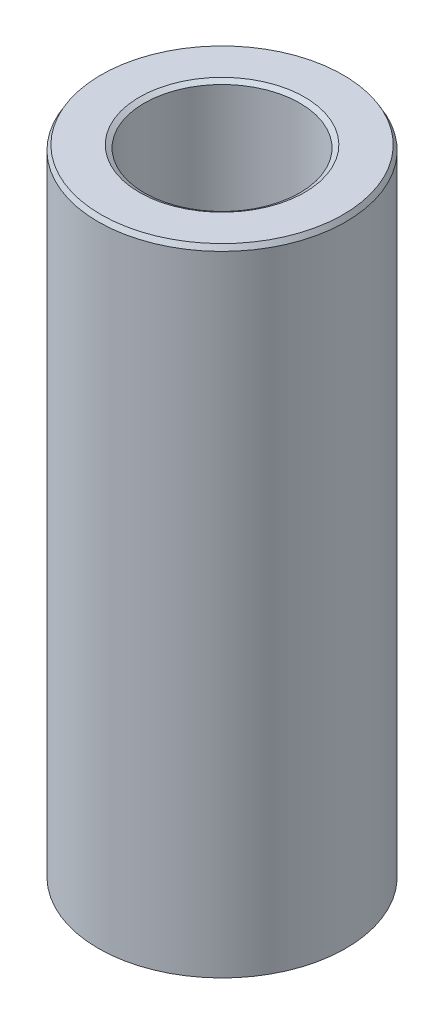
ISO-10303-21;
HEADER;
FILE_DESCRIPTION(('STEP AP214'),'2;1');
FILE_NAME('part.step','',(''),(''),'','','');
FILE_SCHEMA(('AUTOMOTIVE_DESIGN { 1 0 10303 214 1 1 1 1 }'));
ENDSEC;
DATA;
#1=APPLICATION_CONTEXT('core data for automotive mechanical design processes');
#2=APPLICATION_PROTOCOL_DEFINITION('international standard','automotive_design',2000,#1);
#3=PRODUCT_CONTEXT('',#1,'mechanical');
#4=PRODUCT('Part','Part','',(#3));
#5=PRODUCT_RELATED_PRODUCT_CATEGORY('part','',(#4));
#6=PRODUCT_DEFINITION_FORMATION('','',#4);
#7=PRODUCT_DEFINITION_CONTEXT('part definition',#1,'design');
#8=PRODUCT_DEFINITION('design','',#6,#7);
#9=PRODUCT_DEFINITION_SHAPE('','',#8);
#10=(LENGTH_UNIT() NAMED_UNIT(*) SI_UNIT(.MILLI.,.METRE.));
#11=(NAMED_UNIT(*) PLANE_ANGLE_UNIT() SI_UNIT($,.RADIAN.));
#12=(NAMED_UNIT(*) SI_UNIT($,.STERADIAN.) SOLID_ANGLE_UNIT());
#13=UNCERTAINTY_MEASURE_WITH_UNIT(LENGTH_MEASURE(1.E-05),#10,'distance_accuracy_value','');
#14=(GEOMETRIC_REPRESENTATION_CONTEXT(3) GLOBAL_UNCERTAINTY_ASSIGNED_CONTEXT((#13)) GLOBAL_UNIT_ASSIGNED_CONTEXT((#10,
#11,#12)) REPRESENTATION_CONTEXT('',''));
#15=CARTESIAN_POINT('',(0.,0.,0.));
#16=DIRECTION('',(0.,0.,1.));
#17=DIRECTION('',(1.,0.,0.));
#18=AXIS2_PLACEMENT_3D('',#15,#16,#17);
#19=CARTESIAN_POINT('',(0.,308.567477132316,0.));
#20=DIRECTION('',(0.,-1.,0.));
#21=DIRECTION('',(0.,0.,-1.));
#22=AXIS2_PLACEMENT_3D('',#19,#20,#21);
#23=CYLINDRICAL_SURFACE('',#22,60.);
#24=CARTESIAN_POINT('',(0.,1.34867744730599,0.));
#25=DIRECTION('',(0.,1.,0.));
#26=DIRECTION('',(0.,0.,1.));
#27=AXIS2_PLACEMENT_3D('',#24,#25,#26);
#28=CIRCLE('',#27,60.);
#29=CARTESIAN_POINT('',(0.,1.34867744730599,60.));
#30=VERTEX_POINT('',#29);
#31=EDGE_CURVE('E10',#30,#30,#28,.T.);
#32=ORIENTED_EDGE('',*,*,#31,.T.);
#33=EDGE_LOOP('',(#32));
#34=FACE_BOUND('',#33,.T.);
#35=CARTESIAN_POINT('',(0.,306.23149927056,0.));
#36=DIRECTION('',(0.,1.,0.));
#37=DIRECTION('',(0.,0.,1.));
#38=AXIS2_PLACEMENT_3D('',#35,#36,#37);
#39=CIRCLE('',#38,60.);
#40=CARTESIAN_POINT('',(0.,306.23149927056,60.));
#41=VERTEX_POINT('',#40);
#42=EDGE_CURVE('E50',#41,#41,#39,.F.);
#43=ORIENTED_EDGE('',*,*,#42,.T.);
#44=EDGE_LOOP('',(#43));
#45=FACE_BOUND('',#44,.T.);
#46=ADVANCED_FACE('F39',(#34,#45),#23,.T.);
#47=CARTESIAN_POINT('',(0.,308.567477132316,0.));
#48=DIRECTION('',(0.,1.,0.));
#49=DIRECTION('',(0.,0.,1.));
#50=AXIS2_PLACEMENT_3D('',#47,#48,#49);
#51=PLANE('',#50);
#52=CARTESIAN_POINT('',(0.,308.567477132316,0.));
#53=DIRECTION('',(0.,1.,0.));
#54=DIRECTION('',(0.,0.,1.));
#55=AXIS2_PLACEMENT_3D('',#52,#53,#54);
#56=CIRCLE('',#55,40.0320406734365);
#57=CARTESIAN_POINT('',(0.,308.567477132316,40.0320406734365));
#58=VERTEX_POINT('',#57);
#59=EDGE_CURVE('E58',#58,#58,#56,.F.);
#60=ORIENTED_EDGE('',*,*,#59,.T.);
#61=EDGE_LOOP('',(#60));
#62=FACE_BOUND('',#61,.T.);
#63=CARTESIAN_POINT('',(0.,308.567477132316,0.));
#64=DIRECTION('',(0.,1.,0.));
#65=DIRECTION('',(0.,0.,1.));
#66=AXIS2_PLACEMENT_3D('',#63,#64,#65);
#67=CIRCLE('',#66,58.651322552694);
#68=CARTESIAN_POINT('',(0.,308.567477132316,58.651322552694));
#69=VERTEX_POINT('',#68);
#70=EDGE_CURVE('E61',#69,#69,#67,.T.);
#71=ORIENTED_EDGE('',*,*,#70,.T.);
#72=EDGE_LOOP('',(#71));
#73=FACE_BOUND('',#72,.T.);
#74=ADVANCED_FACE('F88',(#62,#73),#51,.T.);
#75=CARTESIAN_POINT('',(0.,0.,0.));
#76=DIRECTION('',(0.,1.,0.));
#77=DIRECTION('',(0.,0.,1.));
#78=AXIS2_PLACEMENT_3D('',#75,#76,#77);
#79=PLANE('',#78);
#80=CARTESIAN_POINT('',(0.,0.,0.));
#81=DIRECTION('',(0.,1.,0.));
#82=DIRECTION('',(0.,0.,1.));
#83=AXIS2_PLACEMENT_3D('',#80,#81,#82);
#84=CIRCLE('',#83,39.0447402589861);
#85=CARTESIAN_POINT('',(0.,0.,39.0447402589861));
#86=VERTEX_POINT('',#85);
#87=EDGE_CURVE('E51',#86,#86,#84,.T.);
#88=ORIENTED_EDGE('',*,*,#87,.T.);
#89=EDGE_LOOP('',(#88));
#90=FACE_BOUND('',#89,.T.);
#91=CARTESIAN_POINT('',(0.,0.,0.));
#92=DIRECTION('',(0.,1.,0.));
#93=DIRECTION('',(0.,0.,1.));
#94=AXIS2_PLACEMENT_3D('',#91,#92,#93);
#95=CIRCLE('',#94,57.6640221382437);
#96=CARTESIAN_POINT('',(0.,0.,57.6640221382437));
#97=VERTEX_POINT('',#96);
#98=EDGE_CURVE('E54',#97,#97,#95,.F.);
#99=ORIENTED_EDGE('',*,*,#98,.T.);
#100=EDGE_LOOP('',(#99));
#101=FACE_BOUND('',#100,.T.);
#102=ADVANCED_FACE('F83',(#90,#101),#79,.F.);
#103=CARTESIAN_POINT('',(0.,308.567477132316,0.));
#104=DIRECTION('',(0.,-1.,0.));
#105=DIRECTION('',(0.,0.,-1.));
#106=AXIS2_PLACEMENT_3D('',#103,#104,#105);
#107=CYLINDRICAL_SURFACE('',#106,37.6960628116802);
#108=CARTESIAN_POINT('',(0.,307.21879968501,0.));
#109=DIRECTION('',(0.,1.,0.));
#110=DIRECTION('',(0.,0.,1.));
#111=AXIS2_PLACEMENT_3D('',#108,#109,#110);
#112=CIRCLE('',#111,37.6960628116802);
#113=CARTESIAN_POINT('',(0.,307.21879968501,37.6960628116802));
#114=VERTEX_POINT('',#113);
#115=EDGE_CURVE('E67',#114,#114,#112,.T.);
#116=ORIENTED_EDGE('',*,*,#115,.T.);
#117=EDGE_LOOP('',(#116));
#118=FACE_BOUND('',#117,.T.);
#119=CARTESIAN_POINT('',(0.,2.33597786175616,0.));
#120=DIRECTION('',(0.,1.,0.));
#121=DIRECTION('',(0.,0.,1.));
#122=AXIS2_PLACEMENT_3D('',#119,#120,#121);
#123=CIRCLE('',#122,37.6960628116802);
#124=CARTESIAN_POINT('',(0.,2.33597786175616,37.6960628116802));
#125=VERTEX_POINT('',#124);
#126=EDGE_CURVE('E69',#125,#125,#123,.F.);
#127=ORIENTED_EDGE('',*,*,#126,.T.);
#128=EDGE_LOOP('',(#127));
#129=FACE_BOUND('',#128,.T.);
#130=ADVANCED_FACE('F71',(#118,#129),#107,.F.);
#131=CARTESIAN_POINT('',(0.,307.21879968501,0.));
#132=DIRECTION('',(0.,1.,0.));
#133=DIRECTION('',(0.,0.,1.));
#134=AXIS2_PLACEMENT_3D('',#131,#132,#133);
#135=CONICAL_SURFACE('',#134,37.6960628116802,1.0471975511966);
#136=ORIENTED_EDGE('',*,*,#59,.F.);
#137=EDGE_LOOP('',(#136));
#138=FACE_BOUND('',#137,.T.);
#139=ORIENTED_EDGE('',*,*,#115,.F.);
#140=EDGE_LOOP('',(#139));
#141=FACE_BOUND('',#140,.T.);
#142=ADVANCED_FACE('F77',(#138,#141),#135,.F.);
#143=CARTESIAN_POINT('',(0.,0.,0.));
#144=DIRECTION('',(0.,-1.,0.));
#145=DIRECTION('',(0.,0.,-1.));
#146=AXIS2_PLACEMENT_3D('',#143,#144,#145);
#147=CONICAL_SURFACE('',#146,39.0447402589861,0.523598775598292);
#148=ORIENTED_EDGE('',*,*,#126,.F.);
#149=EDGE_LOOP('',(#148));
#150=FACE_BOUND('',#149,.T.);
#151=ORIENTED_EDGE('',*,*,#87,.F.);
#152=EDGE_LOOP('',(#151));
#153=FACE_BOUND('',#152,.T.);
#154=ADVANCED_FACE('F73',(#150,#153),#147,.F.);
#155=CARTESIAN_POINT('',(0.,1.34867744730599,0.));
#156=DIRECTION('',(0.,1.,0.));
#157=DIRECTION('',(0.,0.,1.));
#158=AXIS2_PLACEMENT_3D('',#155,#156,#157);
#159=CONICAL_SURFACE('',#158,60.,1.0471975511966);
#160=ORIENTED_EDGE('',*,*,#98,.F.);
#161=EDGE_LOOP('',(#160));
#162=FACE_BOUND('',#161,.T.);
#163=ORIENTED_EDGE('',*,*,#31,.F.);
#164=EDGE_LOOP('',(#163));
#165=FACE_BOUND('',#164,.T.);
#166=ADVANCED_FACE('F76',(#162,#165),#159,.T.);
#167=CARTESIAN_POINT('',(0.,308.567477132316,0.));
#168=DIRECTION('',(0.,-1.,0.));
#169=DIRECTION('',(0.,0.,-1.));
#170=AXIS2_PLACEMENT_3D('',#167,#168,#169);
#171=CONICAL_SURFACE('',#170,58.651322552694,0.523598775598301);
#172=ORIENTED_EDGE('',*,*,#42,.F.);
#173=EDGE_LOOP('',(#172));
#174=FACE_BOUND('',#173,.T.);
#175=ORIENTED_EDGE('',*,*,#70,.F.);
#176=EDGE_LOOP('',(#175));
#177=FACE_BOUND('',#176,.T.);
#178=ADVANCED_FACE('F45',(#174,#177),#171,.T.);
#179=CLOSED_SHELL('',(#46,#74,#102,#130,#142,#154,#166,#178));
#180=MANIFOLD_SOLID_BREP('B2',#179);
#181=ADVANCED_BREP_SHAPE_REPRESENTATION('',(#18,#180),#14);
#182=SHAPE_DEFINITION_REPRESENTATION(#9,#181);
ENDSEC;
END-ISO-10303-21;
